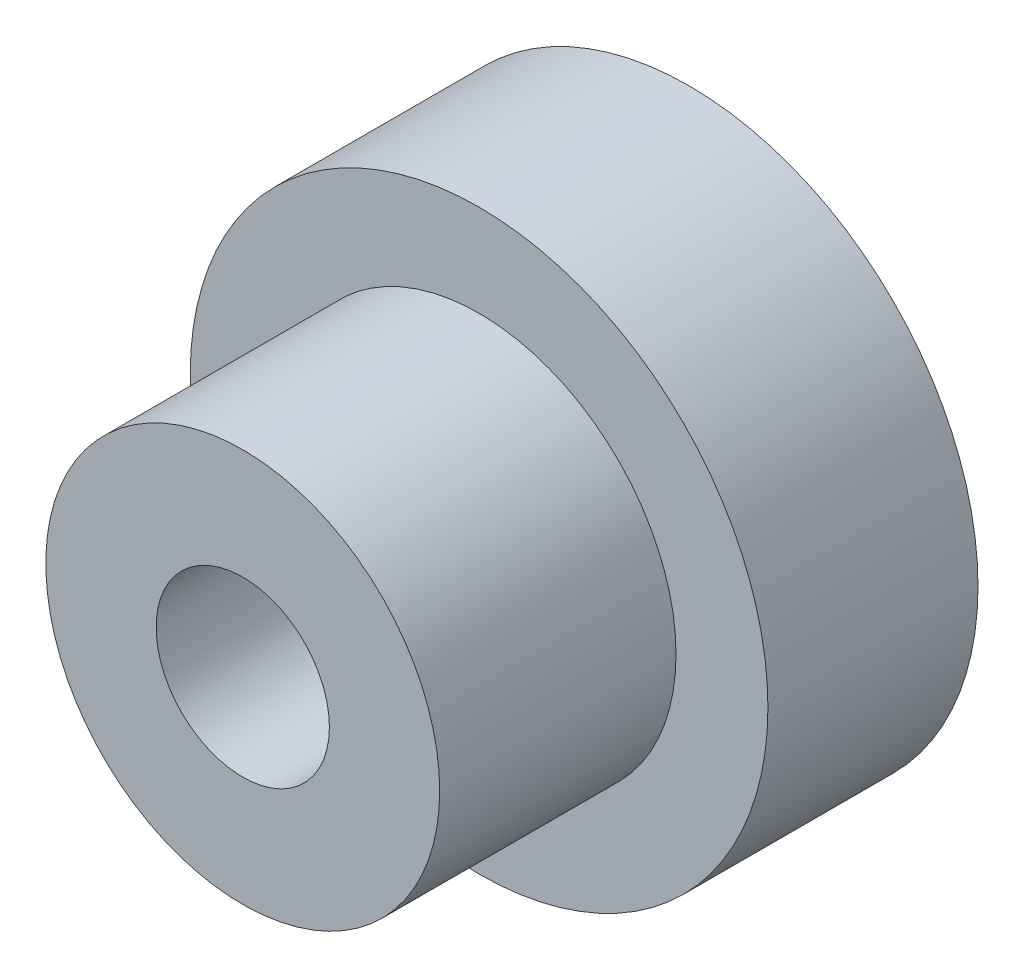
ISO-10303-21;
HEADER;
FILE_DESCRIPTION(('STEP AP214'),'2;1');
FILE_NAME('part.step','',(''),(''),'','','');
FILE_SCHEMA(('AUTOMOTIVE_DESIGN { 1 0 10303 214 1 1 1 1 }'));
ENDSEC;
DATA;
#1=APPLICATION_CONTEXT('core data for automotive mechanical design processes');
#2=APPLICATION_PROTOCOL_DEFINITION('international standard','automotive_design',2000,#1);
#3=PRODUCT_CONTEXT('',#1,'mechanical');
#4=PRODUCT('Part','Part','',(#3));
#5=PRODUCT_RELATED_PRODUCT_CATEGORY('part','',(#4));
#6=PRODUCT_DEFINITION_FORMATION('','',#4);
#7=PRODUCT_DEFINITION_CONTEXT('part definition',#1,'design');
#8=PRODUCT_DEFINITION('design','',#6,#7);
#9=PRODUCT_DEFINITION_SHAPE('','',#8);
#10=(LENGTH_UNIT() NAMED_UNIT(*) SI_UNIT(.MILLI.,.METRE.));
#11=(NAMED_UNIT(*) PLANE_ANGLE_UNIT() SI_UNIT($,.RADIAN.));
#12=(NAMED_UNIT(*) SI_UNIT($,.STERADIAN.) SOLID_ANGLE_UNIT());
#13=UNCERTAINTY_MEASURE_WITH_UNIT(LENGTH_MEASURE(1.E-05),#10,'distance_accuracy_value','');
#14=(GEOMETRIC_REPRESENTATION_CONTEXT(3) GLOBAL_UNCERTAINTY_ASSIGNED_CONTEXT((#13)) GLOBAL_UNIT_ASSIGNED_CONTEXT((#10,
#11,#12)) REPRESENTATION_CONTEXT('',''));
#15=CARTESIAN_POINT('',(0.,0.,0.));
#16=DIRECTION('',(0.,0.,1.));
#17=DIRECTION('',(1.,0.,0.));
#18=AXIS2_PLACEMENT_3D('',#15,#16,#17);
#19=CARTESIAN_POINT('',(0.,0.,8.));
#20=DIRECTION('',(0.,0.,-1.));
#21=DIRECTION('',(-1.,0.,0.));
#22=AXIS2_PLACEMENT_3D('',#19,#20,#21);
#23=CYLINDRICAL_SURFACE('',#22,11.);
#24=CARTESIAN_POINT('',(0.,0.,8.));
#25=DIRECTION('',(0.,0.,1.));
#26=DIRECTION('',(1.,0.,0.));
#27=AXIS2_PLACEMENT_3D('',#24,#25,#26);
#28=CIRCLE('',#27,11.);
#29=CARTESIAN_POINT('',(11.,0.,8.));
#30=VERTEX_POINT('',#29);
#31=EDGE_CURVE('E49',#30,#30,#28,.T.);
#32=ORIENTED_EDGE('',*,*,#31,.F.);
#33=EDGE_LOOP('',(#32));
#34=FACE_BOUND('',#33,.T.);
#35=CARTESIAN_POINT('',(0.,0.,0.));
#36=DIRECTION('',(0.,0.,1.));
#37=DIRECTION('',(1.,0.,0.));
#38=AXIS2_PLACEMENT_3D('',#35,#36,#37);
#39=CIRCLE('',#38,11.);
#40=CARTESIAN_POINT('',(11.,0.,0.));
#41=VERTEX_POINT('',#40);
#42=EDGE_CURVE('E45',#41,#41,#39,.T.);
#43=ORIENTED_EDGE('',*,*,#42,.T.);
#44=EDGE_LOOP('',(#43));
#45=FACE_BOUND('',#44,.T.);
#46=ADVANCED_FACE('F42',(#34,#45),#23,.T.);
#47=CARTESIAN_POINT('',(0.,0.,8.));
#48=DIRECTION('',(0.,0.,1.));
#49=DIRECTION('',(1.,0.,0.));
#50=AXIS2_PLACEMENT_3D('',#47,#48,#49);
#51=PLANE('',#50);
#52=CARTESIAN_POINT('',(0.,0.,8.));
#53=DIRECTION('',(0.,0.,1.));
#54=DIRECTION('',(1.,0.,0.));
#55=AXIS2_PLACEMENT_3D('',#52,#53,#54);
#56=CIRCLE('',#55,7.5);
#57=CARTESIAN_POINT('',(7.5,0.,8.));
#58=VERTEX_POINT('',#57);
#59=EDGE_CURVE('E12',#58,#58,#56,.T.);
#60=ORIENTED_EDGE('',*,*,#59,.F.);
#61=EDGE_LOOP('',(#60));
#62=FACE_BOUND('',#61,.T.);
#63=ORIENTED_EDGE('',*,*,#31,.T.);
#64=EDGE_LOOP('',(#63));
#65=FACE_BOUND('',#64,.T.);
#66=ADVANCED_FACE('F86',(#62,#65),#51,.T.);
#67=CARTESIAN_POINT('',(0.,0.,0.));
#68=DIRECTION('',(0.,0.,1.));
#69=DIRECTION('',(1.,0.,0.));
#70=AXIS2_PLACEMENT_3D('',#67,#68,#69);
#71=PLANE('',#70);
#72=CARTESIAN_POINT('',(0.,0.,0.));
#73=DIRECTION('',(0.,0.,1.));
#74=DIRECTION('',(1.,0.,0.));
#75=AXIS2_PLACEMENT_3D('',#72,#73,#74);
#76=CIRCLE('',#75,3.3);
#77=CARTESIAN_POINT('',(3.3,0.,0.));
#78=VERTEX_POINT('',#77);
#79=EDGE_CURVE('E58',#78,#78,#76,.T.);
#80=ORIENTED_EDGE('',*,*,#79,.T.);
#81=EDGE_LOOP('',(#80));
#82=FACE_BOUND('',#81,.T.);
#83=ORIENTED_EDGE('',*,*,#42,.F.);
#84=EDGE_LOOP('',(#83));
#85=FACE_BOUND('',#84,.T.);
#86=ADVANCED_FACE('F65',(#82,#85),#71,.F.);
#87=CARTESIAN_POINT('',(0.,0.,17.));
#88=DIRECTION('',(0.,0.,-1.));
#89=DIRECTION('',(-1.,0.,0.));
#90=AXIS2_PLACEMENT_3D('',#87,#88,#89);
#91=CYLINDRICAL_SURFACE('',#90,7.5);
#92=CARTESIAN_POINT('',(0.,0.,17.));
#93=DIRECTION('',(0.,0.,1.));
#94=DIRECTION('',(1.,0.,0.));
#95=AXIS2_PLACEMENT_3D('',#92,#93,#94);
#96=CIRCLE('',#95,7.5);
#97=CARTESIAN_POINT('',(7.5,0.,17.));
#98=VERTEX_POINT('',#97);
#99=EDGE_CURVE('E55',#98,#98,#96,.T.);
#100=ORIENTED_EDGE('',*,*,#99,.F.);
#101=EDGE_LOOP('',(#100));
#102=FACE_BOUND('',#101,.T.);
#103=ORIENTED_EDGE('',*,*,#59,.T.);
#104=EDGE_LOOP('',(#103));
#105=FACE_BOUND('',#104,.T.);
#106=ADVANCED_FACE('F77',(#102,#105),#91,.T.);
#107=CARTESIAN_POINT('',(0.,0.,17.));
#108=DIRECTION('',(0.,0.,1.));
#109=DIRECTION('',(1.,0.,0.));
#110=AXIS2_PLACEMENT_3D('',#107,#108,#109);
#111=PLANE('',#110);
#112=CARTESIAN_POINT('',(0.,0.,17.));
#113=DIRECTION('',(0.,0.,1.));
#114=DIRECTION('',(1.,0.,0.));
#115=AXIS2_PLACEMENT_3D('',#112,#113,#114);
#116=CIRCLE('',#115,3.3);
#117=CARTESIAN_POINT('',(3.3,0.,17.));
#118=VERTEX_POINT('',#117);
#119=EDGE_CURVE('E59',#118,#118,#116,.T.);
#120=ORIENTED_EDGE('',*,*,#119,.F.);
#121=EDGE_LOOP('',(#120));
#122=FACE_BOUND('',#121,.T.);
#123=ORIENTED_EDGE('',*,*,#99,.T.);
#124=EDGE_LOOP('',(#123));
#125=FACE_BOUND('',#124,.T.);
#126=ADVANCED_FACE('F71',(#122,#125),#111,.T.);
#127=CARTESIAN_POINT('',(0.,0.,0.));
#128=DIRECTION('',(0.,0.,1.));
#129=DIRECTION('',(1.,0.,0.));
#130=AXIS2_PLACEMENT_3D('',#127,#128,#129);
#131=CYLINDRICAL_SURFACE('',#130,3.3);
#132=ORIENTED_EDGE('',*,*,#79,.F.);
#133=EDGE_LOOP('',(#132));
#134=FACE_BOUND('',#133,.T.);
#135=ORIENTED_EDGE('',*,*,#119,.T.);
#136=EDGE_LOOP('',(#135));
#137=FACE_BOUND('',#136,.T.);
#138=ADVANCED_FACE('F68',(#134,#137),#131,.F.);
#139=CLOSED_SHELL('',(#46,#66,#86,#106,#126,#138));
#140=MANIFOLD_SOLID_BREP('B2',#139);
#141=ADVANCED_BREP_SHAPE_REPRESENTATION('',(#18,#140),#14);
#142=SHAPE_DEFINITION_REPRESENTATION(#9,#141);
ENDSEC;
END-ISO-10303-21;
